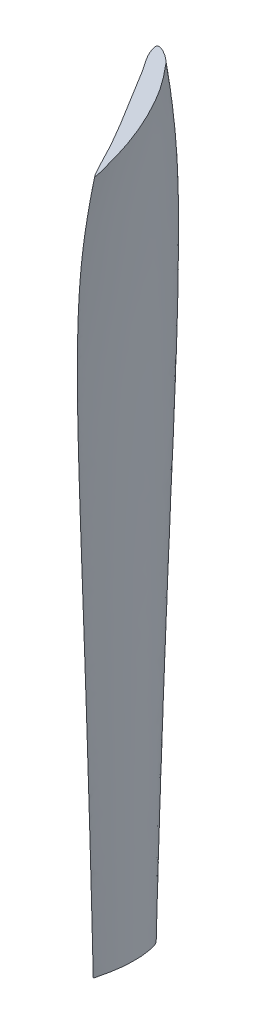
ISO-10303-21;
HEADER;
FILE_DESCRIPTION(('STEP AP214'),'2;1');
FILE_NAME('part.step','',(''),(''),'','','');
FILE_SCHEMA(('AUTOMOTIVE_DESIGN { 1 0 10303 214 1 1 1 1 }'));
ENDSEC;
DATA;
#1=APPLICATION_CONTEXT('core data for automotive mechanical design processes');
#2=APPLICATION_PROTOCOL_DEFINITION('international standard','automotive_design',2000,#1);
#3=PRODUCT_CONTEXT('',#1,'mechanical');
#4=PRODUCT('Part','Part','',(#3));
#5=PRODUCT_RELATED_PRODUCT_CATEGORY('part','',(#4));
#6=PRODUCT_DEFINITION_FORMATION('','',#4);
#7=PRODUCT_DEFINITION_CONTEXT('part definition',#1,'design');
#8=PRODUCT_DEFINITION('design','',#6,#7);
#9=PRODUCT_DEFINITION_SHAPE('','',#8);
#10=(LENGTH_UNIT() NAMED_UNIT(*) SI_UNIT(.MILLI.,.METRE.));
#11=(NAMED_UNIT(*) PLANE_ANGLE_UNIT() SI_UNIT($,.RADIAN.));
#12=(NAMED_UNIT(*) SI_UNIT($,.STERADIAN.) SOLID_ANGLE_UNIT());
#13=UNCERTAINTY_MEASURE_WITH_UNIT(LENGTH_MEASURE(1.E-05),#10,'distance_accuracy_value','');
#14=(GEOMETRIC_REPRESENTATION_CONTEXT(3) GLOBAL_UNCERTAINTY_ASSIGNED_CONTEXT((#13)) GLOBAL_UNIT_ASSIGNED_CONTEXT((#10,
#11,#12)) REPRESENTATION_CONTEXT('',''));
#15=CARTESIAN_POINT('',(0.,0.,0.));
#16=DIRECTION('',(0.,0.,1.));
#17=DIRECTION('',(1.,0.,0.));
#18=AXIS2_PLACEMENT_3D('',#15,#16,#17);
#19=CARTESIAN_POINT('',(0.0157186895464114,-30.48,-1.16227222746938));
#20=DIRECTION('',(-1.25062019432119E-13,-1.,0.));
#21=DIRECTION('',(1.,-1.25062019432119E-13,0.));
#22=AXIS2_PLACEMENT_3D('',#19,#20,#21);
#23=PLANE('',#22);
#24=CARTESIAN_POINT('',(0.049898808,-30.48,1.0506202));
#25=CARTESIAN_POINT('',(0.062181298011678,-30.48,1.05336353258307));
#26=CARTESIAN_POINT('',(0.124583873028353,-30.48,0.760655355643803));
#27=CARTESIAN_POINT('',(0.177610202128464,-30.48,0.535751903327124));
#28=CARTESIAN_POINT('',(0.228017025033434,-30.48,0.173947998585792));
#29=CARTESIAN_POINT('',(0.242584017431504,-30.48,-0.179638407304109));
#30=CARTESIAN_POINT('',(0.230753189717951,-30.48,-0.517913748281402));
#31=CARTESIAN_POINT('',(0.176691479359809,-30.48,-0.821728392154921));
#32=CARTESIAN_POINT('',(0.139307850278164,-30.48,-1.00981587623499));
#33=CARTESIAN_POINT('',(-0.0136371864036877,-30.48,-1.22915572336016));
#34=CARTESIAN_POINT('',(-0.0541103687209295,-30.48,-0.996606442321128));
#35=CARTESIAN_POINT('',(-0.0226785507100077,-30.48,-0.816517084452289));
#36=CARTESIAN_POINT('',(-0.0105979802455246,-30.48,-0.514678939828489));
#37=CARTESIAN_POINT('',(0.012223390379104,-30.48,-0.178391739372337));
#38=CARTESIAN_POINT('',(0.0334925128091805,-30.48,0.173454381904055));
#39=CARTESIAN_POINT('',(0.0473966447907424,-30.48,0.533794157721093));
#40=CARTESIAN_POINT('',(0.0412628972993841,-30.48,0.761870302583174));
#41=CARTESIAN_POINT('',(0.0380688541283339,-30.48,1.04797794278005));
#42=CARTESIAN_POINT('',(0.049898808,-30.48,1.0506202));
#43=B_SPLINE_CURVE_WITH_KNOTS('',3,(#24,#25,#26,#27,#28,#29,#30,#31,#32,#33,#34,#35,#36,#37,#38,
#39,#40,#41,#42),.UNSPECIFIED.,.T.,.F.,(4,1,1,1,1,1,1,1,1,1,1,1,1,1,1,1,4),(0.,
0.0499042290990835,0.117585742091255,0.196099475849759,0.277933365973876,0.355728421398949,
0.422610147432165,0.473113194698633,0.507581508155917,0.5340734610851,0.582151449413021,
0.648386078845603,0.726227551361263,0.808058653690017,0.885809032514325,0.951934442634848,1.),.UNSPECIFIED.);
#44=CARTESIAN_POINT('',(0.049898808,-30.48,1.0506202));
#45=VERTEX_POINT('',#44);
#46=EDGE_CURVE('E11',#45,#45,#43,.T.);
#47=ORIENTED_EDGE('',*,*,#46,.F.);
#48=EDGE_LOOP('',(#47));
#49=FACE_BOUND('',#48,.T.);
#50=ADVANCED_FACE('F133',(#49),#23,.T.);
#51=CARTESIAN_POINT('',(-1.38769956039375,-5.08,-2.67627144628854));
#52=DIRECTION('',(0.,-1.,0.));
#53=DIRECTION('',(0.,0.,-1.));
#54=AXIS2_PLACEMENT_3D('',#51,#52,#53);
#55=PLANE('',#54);
#56=CARTESIAN_POINT('',(1.40094716,-5.08,2.3406608));
#57=CARTESIAN_POINT('',(1.43238584616427,-5.08,2.33188778533643));
#58=CARTESIAN_POINT('',(1.21651270986071,-5.08,1.5863044564638));
#59=CARTESIAN_POINT('',(1.0622548487526,-5.08,1.00721070684705));
#60=CARTESIAN_POINT('',(0.73432578498077,-5.08,0.11836342789297));
#61=CARTESIAN_POINT('',(0.334526557644723,-5.08,-0.707798144113323));
#62=CARTESIAN_POINT('',(-0.106863394645317,-5.08,-1.46662375068857));
#63=CARTESIAN_POINT('',(-0.602586270125994,-5.08,-2.09494231326542));
#64=CARTESIAN_POINT('',(-0.918428180750992,-5.08,-2.47913404435551));
#65=CARTESIAN_POINT('',(-1.53673190649153,-5.08,-2.79321031749995));
#66=CARTESIAN_POINT('',(-1.34441589427649,-5.08,-2.21201959031185));
#67=CARTESIAN_POINT('',(-1.05197395459458,-5.08,-1.83882538546198));
#68=CARTESIAN_POINT('',(-0.654642818928523,-5.08,-1.16360294615252));
#69=CARTESIAN_POINT('',(-0.190563933950765,-5.08,-0.42278461670064));
#70=CARTESIAN_POINT('',(0.289025266022224,-5.08,0.355503173889369));
#71=CARTESIAN_POINT('',(0.762179885391635,-5.08,1.16222944612072));
#72=CARTESIAN_POINT('',(1.02752441163478,-5.08,1.69113726735064));
#73=CARTESIAN_POINT('',(1.37066679259692,-5.08,2.34911058399726));
#74=CARTESIAN_POINT('',(1.40094716,-5.08,2.3406608));
#75=B_SPLINE_CURVE_WITH_KNOTS('',3,(#56,#57,#58,#59,#60,#61,#62,#63,#64,#65,#66,#67,#68,#69,#70,
#71,#72,#73,#74),.UNSPECIFIED.,.T.,.F.,(4,1,1,1,1,1,1,1,1,1,1,1,1,1,1,1,4),(0.,
0.0499045000031389,0.117585674311328,0.196099642767479,0.277933685986463,0.35572859176931,
0.422610252007502,0.47311367030944,0.507581613356843,0.534073080911915,0.582151530742124,
0.648386018827515,0.726227469856398,0.808058517091565,0.88580884531264,0.951934168391572,1.),.UNSPECIFIED.);
#76=CARTESIAN_POINT('',(1.40094716,-5.08,2.3406608));
#77=VERTEX_POINT('',#76);
#78=EDGE_CURVE('E144',#77,#77,#75,.T.);
#79=ORIENTED_EDGE('',*,*,#78,.T.);
#80=EDGE_LOOP('',(#79));
#81=FACE_BOUND('',#80,.T.);
#82=ADVANCED_FACE('F174',(#81),#55,.F.);
#83=CARTESIAN_POINT('',(1.40094716,-5.08,2.3406608));
#84=CARTESIAN_POINT('',(1.27778128642703,-5.92643078703215,2.41200499433178));
#85=CARTESIAN_POINT('',(1.04747557121227,-7.61944176717066,2.48297542598399));
#86=CARTESIAN_POINT('',(0.716560358835949,-10.1570873547836,2.27400982890085));
#87=CARTESIAN_POINT('',(0.500776535547632,-12.6967305693978,2.05092070461862));
#88=CARTESIAN_POINT('',(0.351710809646487,-15.2375738948922,1.83338994399882));
#89=CARTESIAN_POINT('',(0.251182575267671,-17.7783750910469,1.64533006673062));
#90=CARTESIAN_POINT('',(0.181142984651728,-20.3189427988014,1.48464936970091));
#91=CARTESIAN_POINT('',(0.131534763644097,-22.8593094206892,1.34860642339307));
#92=CARTESIAN_POINT('',(0.0955383414889097,-25.3995395303378,1.23287248602043));
#93=CARTESIAN_POINT('',(0.0691369906348381,-27.9396954219791,1.1341166253429));
#94=CARTESIAN_POINT('',(0.0555142684237271,-29.6332392153276,1.07686902533856));
#95=CARTESIAN_POINT('',(0.049898808,-30.48,1.0506202));
#96=CARTESIAN_POINT('',(1.39700980387952,-5.08,2.34175952539839));
#97=CARTESIAN_POINT('',(1.27378966033151,-5.92643091249303,2.41289649150168));
#98=CARTESIAN_POINT('',(1.04347227647872,-7.61944170896178,2.48350747809207));
#99=CARTESIAN_POINT('',(0.712990205072126,-10.1570873703868,2.27414560891697));
#100=CARTESIAN_POINT('',(0.497614083614096,-12.6967305650598,2.05083299789722));
#101=CARTESIAN_POINT('',(0.348921812651149,-15.2375738966921,1.83317287047209));
#102=CARTESIAN_POINT('',(0.248705103885671,-17.7783750881789,1.64504208483902));
#103=CARTESIAN_POINT('',(0.178925482983493,-20.3189428084611,1.48432397569785));
#104=CARTESIAN_POINT('',(0.129533553341587,-22.8593093849535,1.34826212075185));
#105=CARTESIAN_POINT('',(0.0937185334445583,-25.3995396635336,1.23252605969023));
#106=CARTESIAN_POINT('',(0.0674707282312418,-27.939694925149,1.13375545148902));
#107=CARTESIAN_POINT('',(0.0539352610077255,-29.6332402855858,1.07654979046761));
#108=CARTESIAN_POINT('',(0.0483605503421055,-30.48,1.05027662533802));
#109=CARTESIAN_POINT('',(1.36709545936726,-5.08,2.32186446235665));
#110=CARTESIAN_POINT('',(1.24492972363605,-5.92643565606058,2.39145105990447));
#111=CARTESIAN_POINT('',(1.01694466015745,-7.6194395084711,2.45990073355303));
#112=CARTESIAN_POINT('',(0.691633254759536,-10.1570879591526,2.25123615778126));
#113=CARTESIAN_POINT('',(0.480054245255558,-12.6967304054009,2.02929568548133));
#114=CARTESIAN_POINT('',(0.334371878808419,-15.2375739485437,1.81336037570565));
#115=CARTESIAN_POINT('',(0.236409966742215,-17.7783750400476,1.62691505621074));
#116=CARTESIAN_POINT('',(0.168373696377399,-20.318942949012,1.46761013663171));
#117=CARTESIAN_POINT('',(0.12034110731012,-22.859308871377,1.33328481339791));
#118=CARTESIAN_POINT('',(0.085653634988587,-25.3995415760398,1.21765592020702));
#119=CARTESIAN_POINT('',(0.0600837221565524,-27.939687791819,1.12364158909274));
#120=CARTESIAN_POINT('',(0.0470389923501114,-29.6332556519332,1.06647300950178));
#121=CARTESIAN_POINT('',(0.0416880054142354,-30.48,1.04011211064734));
#122=CARTESIAN_POINT('',(1.22409976139633,-5.08,2.07273842927985));
#123=CARTESIAN_POINT('',(1.11499496133002,-5.92647276906755,2.13497826673415));
#124=CARTESIAN_POINT('',(0.911355304328161,-7.61942229212017,2.19632665244251));
#125=CARTESIAN_POINT('',(0.620911426110765,-10.1570925656456,2.01106108994917));
#126=CARTESIAN_POINT('',(0.431368142260886,-12.6967291559859,1.81257360213513));
#127=CARTESIAN_POINT('',(0.300997926040138,-15.2375743552128,1.61967039945365));
#128=CARTESIAN_POINT('',(0.213214196969777,-17.7783746597929,1.45337694733169));
#129=CARTESIAN_POINT('',(0.152245128249323,-20.31894406238,1.31030483499396));
#130=CARTESIAN_POINT('',(0.109157783662763,-22.8593048020909,1.19359824706943));
#131=CARTESIAN_POINT('',(0.0783980913444241,-25.3995567299215,1.08149467037754));
#132=CARTESIAN_POINT('',(0.0538336226735565,-27.9396312702883,1.02867195783913));
#133=CARTESIAN_POINT('',(0.0421236401843173,-29.6333774084725,0.973898557552879));
#134=CARTESIAN_POINT('',(0.0373939002388563,-30.48,0.946501084684309));
#135=CARTESIAN_POINT('',(1.00693991362816,-5.08000000000001,1.64550951025166));
#136=CARTESIAN_POINT('',(0.92033059766842,-5.92655739550925,1.69672043173318));
#137=CARTESIAN_POINT('',(0.757993078717222,-7.61938303972482,1.74846610736303));
#138=CARTESIAN_POINT('',(0.522405477410743,-10.1571030522063,1.60374730212956));
#139=CARTESIAN_POINT('',(0.368431435537863,-12.6967263711845,1.44793532878533));
#140=CARTESIAN_POINT('',(0.261398784822616,-15.2375750439937,1.29497240145854));
#141=CARTESIAN_POINT('',(0.189014189051383,-17.7783746805686,1.16276266579985));
#142=CARTESIAN_POINT('',(0.138354155455108,-20.3189432933383,1.04975768757835));
#143=CARTESIAN_POINT('',(0.102211575428987,-22.8593078541443,0.952413465822633));
#144=CARTESIAN_POINT('',(0.0758812168876077,-25.3995452982818,0.871236128744482));
#145=CARTESIAN_POINT('',(0.0570495956875119,-27.9396739261336,0.802751243775289));
#146=CARTESIAN_POINT('',(0.0469555375101602,-29.63328551771,0.762209797664295));
#147=CARTESIAN_POINT('',(0.0427352291163434,-30.48,0.743513942588085));
#148=CARTESIAN_POINT('',(0.860083406694233,-5.07999999999999,1.36125161387565));
#149=CARTESIAN_POINT('',(0.789178500918983,-5.92675659091788,1.40832452802361));
#150=CARTESIAN_POINT('',(0.655164573307827,-7.61929064363724,1.45647279649003));
#151=CARTESIAN_POINT('',(0.448416564371003,-10.1571277462195,1.3052051573593));
#152=CARTESIAN_POINT('',(0.322346315149617,-12.6967197772608,1.18703175023137));
#153=CARTESIAN_POINT('',(0.231681381918034,-15.2375768102546,1.06058115587115));
#154=CARTESIAN_POINT('',(0.170590043393699,-17.7783741897577,0.953039958627092));
#155=CARTESIAN_POINT('',(0.127417789121077,-20.3189434939232,0.86068947262639));
#156=CARTESIAN_POINT('',(0.0966131776601687,-22.8593075422374,0.782086155820854));
#157=CARTESIAN_POINT('',(0.0738364623926254,-25.39954634476,0.716521712861613));
#158=CARTESIAN_POINT('',(0.0574232306792985,-27.9396700537997,0.655447190901884));
#159=CARTESIAN_POINT('',(0.0486187259384814,-29.6332938538326,0.622854951018198));
#160=CARTESIAN_POINT('',(0.044926914263238,-30.48,0.608160994269926));
#161=CARTESIAN_POINT('',(0.703390609799626,-5.08,1.06945966284957));
#162=CARTESIAN_POINT('',(0.646738630941161,-5.92654911432795,1.10393904865062));
#163=CARTESIAN_POINT('',(0.539808562538208,-7.61938688050085,1.14033940576483));
#164=CARTESIAN_POINT('',(0.384149229943514,-10.1571020270684,1.06401640032938));
#165=CARTESIAN_POINT('',(0.276154958267755,-12.6967266398733,0.956797714540188));
#166=CARTESIAN_POINT('',(0.202012536461835,-15.2375749907938,0.85858600980791));
#167=CARTESIAN_POINT('',(0.150722738278815,-17.7783746256743,0.771187567683224));
#168=CARTESIAN_POINT('',(0.114501388311614,-20.318943565535,0.695846654674289));
#169=CARTESIAN_POINT('',(0.0887989329373363,-22.8593068213107,0.637551143162792));
#170=CARTESIAN_POINT('',(0.0694526686231361,-25.3995491548906,0.581306924859225));
#171=CARTESIAN_POINT('',(0.0546219342441351,-27.9396595388234,0.537488105942003));
#172=CARTESIAN_POINT('',(0.0470808122762938,-29.6333165108052,0.510316208151042));
#173=CARTESIAN_POINT('',(0.0439528237016477,-30.48,0.497764298309623));
#174=CARTESIAN_POINT('',(0.521744727348833,-5.08,0.75349620999737));
#175=CARTESIAN_POINT('',(0.482190737245425,-5.92666732160427,0.78086708970373));
#176=CARTESIAN_POINT('',(0.406771940210008,-7.61933205044298,0.810535356031964));
#177=CARTESIAN_POINT('',(0.289367763071413,-10.157116681185,0.740212770955006));
#178=CARTESIAN_POINT('',(0.213317424872538,-12.696722726498,0.673995527688344));
#179=CARTESIAN_POINT('',(0.158418174991844,-15.2375760403644,0.603643875026136));
#180=CARTESIAN_POINT('',(0.120815559006764,-17.7783743290943,0.544559432981544));
#181=CARTESIAN_POINT('',(0.0935841964948799,-20.3189437043909,0.489062515624401));
#182=CARTESIAN_POINT('',(0.0747342488519041,-22.8593065623163,0.456594678362163));
#183=CARTESIAN_POINT('',(0.0597318267451517,-25.399550051497,0.414515555217572));
#184=CARTESIAN_POINT('',(0.0485459084996442,-27.9396562128339,0.383439233047924));
#185=CARTESIAN_POINT('',(0.0426520586380554,-29.6333236722734,0.364024303790033));
#186=CARTESIAN_POINT('',(0.0401783489449294,-30.48,0.355146831708664));
#187=CARTESIAN_POINT('',(0.327594926511205,-5.08,0.425241302049337));
#188=CARTESIAN_POINT('',(0.305074775895395,-5.92664950657036,0.441640737924192));
#189=CARTESIAN_POINT('',(0.261603031386557,-7.61934031379656,0.460409733059054));
#190=CARTESIAN_POINT('',(0.193085046665425,-10.1571144729812,0.431188643482622));
#191=CARTESIAN_POINT('',(0.145119879539118,-12.6967233150986,0.39056586890181));
#192=CARTESIAN_POINT('',(0.111028384982007,-15.237575886588,0.351833665576553));
#193=CARTESIAN_POINT('',(0.0869343981256386,-17.7783743573969,0.316646153482897));
#194=CARTESIAN_POINT('',(0.0695428034090461,-20.3189437445462,0.287889728637838));
#195=CARTESIAN_POINT('',(0.0566872354373561,-22.8593063736428,0.258541251519454));
#196=CARTESIAN_POINT('',(0.0469591833663303,-25.3995507655577,0.238375955122035));
#197=CARTESIAN_POINT('',(0.0398332290463775,-27.9396535464326,0.217966595506903));
#198=CARTESIAN_POINT('',(0.0358337275570815,-29.6333294166825,0.207347933711566));
#199=CARTESIAN_POINT('',(0.0341041569733386,-30.48,0.202524488617393));
#200=CARTESIAN_POINT('',(0.135350731479312,-5.07999999999999,0.10769732427186));
#201=CARTESIAN_POINT('',(0.129675011026332,-5.92666977232785,0.114879574949974));
#202=CARTESIAN_POINT('',(0.117646197574036,-7.61933091354864,0.124436799822662));
#203=CARTESIAN_POINT('',(0.0928272024114742,-10.1571169854694,0.117287582813142));
#204=CARTESIAN_POINT('',(0.075396528147237,-12.6967226436281,0.109881314047684));
#205=CARTESIAN_POINT('',(0.0616782464640057,-15.2375760685788,0.100119342971943));
#206=CARTESIAN_POINT('',(0.0515805366846222,-17.7783742989207,0.0915746742476821));
#207=CARTESIAN_POINT('',(0.0438632685164775,-20.3189437967771,0.0831350948704369));
#208=CARTESIAN_POINT('',(0.0378339391015915,-22.8593062232748,0.0779108998407389));
#209=CARTESIAN_POINT('',(0.0331756877715342,-25.3995513144516,0.071028574941251));
#210=CARTESIAN_POINT('',(0.029191766338835,-27.9396515021169,0.0669013442622828));
#211=CARTESIAN_POINT('',(0.0271270232668996,-29.6333338199395,0.0636612815757055));
#212=CARTESIAN_POINT('',(0.0262309147671311,-30.48,0.0621131631861524));
#213=CARTESIAN_POINT('',(-0.0547789495885922,-5.08000000000001,-0.202046851421453));
#214=CARTESIAN_POINT('',(-0.0442193189636415,-5.92666652291648,-0.204860448524149));
#215=CARTESIAN_POINT('',(-0.0257641263728181,-7.61933242078096,-0.205422027268839));
#216=CARTESIAN_POINT('',(-0.00539275225699148,-10.1571165826289,-0.181994018923111));
#217=CARTESIAN_POINT('',(0.00572005255645679,-12.6967227512476,-0.161515969382117));
#218=CARTESIAN_POINT('',(0.0122155818325014,-15.2375760395625,-0.142261708966033));
#219=CARTESIAN_POINT('',(0.0156913446249202,-17.7783743076859,-0.126486971690394));
#220=CARTESIAN_POINT('',(0.0175090565951182,-20.3189437906786,-0.112920227533355));
#221=CARTESIAN_POINT('',(0.0183774128838644,-22.8593062388995,-0.102727119987911));
#222=CARTESIAN_POINT('',(0.0185905718268447,-25.3995512580865,-0.0930135288524093));
#223=CARTESIAN_POINT('',(0.0186065765327255,-27.9396517118607,-0.0858066110114175));
#224=CARTESIAN_POINT('',(0.0184091979719757,-29.6333333682046,-0.0812191313918362));
#225=CARTESIAN_POINT('',(0.0182649012114125,-30.48,-0.0791013441155834));
#226=CARTESIAN_POINT('',(-0.245908220493335,-5.07999999999999,-0.509847484958227));
#227=CARTESIAN_POINT('',(-0.219102959023463,-5.92665717814351,-0.522235639733509));
#228=CARTESIAN_POINT('',(-0.170174684785107,-7.61933675536502,-0.532555827727952));
#229=CARTESIAN_POINT('',(-0.105814403515541,-10.1571154240145,-0.483748830616579));
#230=CARTESIAN_POINT('',(-0.0652974216217071,-12.6967230611567,-0.433472338821281));
#231=CARTESIAN_POINT('',(-0.0385472539613965,-15.2375759545794,-0.385755960396873));
#232=CARTESIAN_POINT('',(-0.0212514695740547,-17.7783743386143,-0.344892955525923));
#233=CARTESIAN_POINT('',(-0.00976731801714596,-20.3189437518243,-0.310511424731755));
#234=CARTESIAN_POINT('',(-0.00206852855155911,-22.8593063632965,-0.281000343622873));
#235=CARTESIAN_POINT('',(0.0032366854105813,-25.3995507996468,-0.256616145979663));
#236=CARTESIAN_POINT('',(0.0067865686048866,-27.9396534204772,-0.235374432902474));
#237=CARTESIAN_POINT('',(0.00854274227419979,-29.6333296877981,-0.223321397638403));
#238=CARTESIAN_POINT('',(0.00922139160907255,-30.48,-0.217822275468259));
#239=CARTESIAN_POINT('',(-0.43692697195276,-5.08,-0.816268192622552));
#240=CARTESIAN_POINT('',(-0.394013602580028,-5.92664099767442,-0.838487390151797));
#241=CARTESIAN_POINT('',(-0.314808815528985,-7.61934426069718,-0.858833734810288));
#242=CARTESIAN_POINT('',(-0.205955636223482,-10.1571134178667,-0.782415433629516));
#243=CARTESIAN_POINT('',(-0.136439268711224,-12.696723597792,-0.703160492164974));
#244=CARTESIAN_POINT('',(-0.0894385174010106,-15.2375758073286,-0.627019989989802));
#245=CARTESIAN_POINT('',(-0.058434965896887,-17.7783743925493,-0.561729111217014));
#246=CARTESIAN_POINT('',(-0.0372955440939636,-20.318943683123,-0.506038107535369));
#247=CARTESIAN_POINT('',(-0.0226784250820971,-22.8593065840023,-0.459358126138431));
#248=CARTESIAN_POINT('',(-0.012371686359618,-25.399549986048,-0.419470291099731));
#249=CARTESIAN_POINT('',(-0.00498821938010917,-27.9396564528419,-0.385732417111443));
#250=CARTESIAN_POINT('',(-0.00130483128532693,-29.633323155991,-0.366098191631045));
#251=CARTESIAN_POINT('',(0.000167597918726979,-30.4800000000001,-0.357101184112708));
#252=CARTESIAN_POINT('',(-0.631440850298294,-5.08,-1.13192540458864));
#253=CARTESIAN_POINT('',(-0.571891849673466,-5.92661398392929,-1.16399803334085));
#254=CARTESIAN_POINT('',(-0.461492944701545,-7.61935679105383,-1.19436561990713));
#255=CARTESIAN_POINT('',(-0.307357276327262,-10.1571100685641,-1.09027392370671));
#256=CARTESIAN_POINT('',(-0.208157503153315,-12.6967244936562,-0.981647007290554));
#257=CARTESIAN_POINT('',(-0.140502916490108,-15.2375755617238,-0.876081580374542));
#258=CARTESIAN_POINT('',(-0.0954544983359994,-17.7783744817214,-0.785210690704693));
#259=CARTESIAN_POINT('',(-0.0645304362563312,-20.3189435716804,-0.70794504980153));
#260=CARTESIAN_POINT('',(-0.0429440570203945,-22.8593069403389,-0.642487024491648));
#261=CARTESIAN_POINT('',(-0.0275070950002347,-25.3995486729872,-0.586971230344392));
#262=CARTESIAN_POINT('',(-0.0164215165775531,-27.939661346612,-0.539615093499802));
#263=CARTESIAN_POINT('',(-0.0107749229361149,-29.6333126146839,-0.512204136178297));
#264=CARTESIAN_POINT('',(-0.00848448981291489,-30.4799999999999,-0.499647940275508));
#265=CARTESIAN_POINT('',(-0.821691805311017,-5.08,-1.44828150591257));
#266=CARTESIAN_POINT('',(-0.74551764208252,-5.92657874790718,-1.49009138655135));
#267=CARTESIAN_POINT('',(-0.603996880769097,-7.61937313532556,-1.53011820480454));
#268=CARTESIAN_POINT('',(-0.405065289112894,-10.1571056998131,-1.39823284599796));
#269=CARTESIAN_POINT('',(-0.276432767268611,-12.6967256622289,-1.25811311318379));
#270=CARTESIAN_POINT('',(-0.188567655226749,-15.2375752412497,-1.12342456431561));
#271=CARTESIAN_POINT('',(-0.129940385752425,-17.7783745984587,-1.00738856093221));
#272=CARTESIAN_POINT('',(-0.0894494769056676,-20.3189434247395,-0.908269763265217));
#273=CARTESIAN_POINT('',(-0.061112132891369,-22.8593074110174,-0.824600521038328));
#274=CARTESIAN_POINT('',(-0.0408125489279891,-25.3995469383282,-0.753613917522465));
#275=CARTESIAN_POINT('',(-0.0260867951283854,-27.9396678117457,-0.692972289844512));
#276=CARTESIAN_POINT('',(-0.0185936133356453,-29.6332986886068,-0.657902310245891));
#277=CARTESIAN_POINT('',(-0.0155445222538459,-30.4800000000001,-0.641837804394526));
#278=CARTESIAN_POINT('',(-1.02159205782382,-5.07999999999999,-1.77629494038124));
#279=CARTESIAN_POINT('',(-0.928122918263087,-5.92653570010902,-1.82823348231052));
#280=CARTESIAN_POINT('',(-0.75421343201836,-7.61939310310524,-1.87854792908362));
#281=CARTESIAN_POINT('',(-0.508284677566144,-10.1571003624945,-1.71660714814156));
#282=CARTESIAN_POINT('',(-0.349344354167996,-12.6967270899525,-1.5477472519768));
#283=CARTESIAN_POINT('',(-0.240255925978484,-15.2375748494286,-1.38216839365587));
#284=CARTESIAN_POINT('',(-0.167113597498268,-17.7783747421865,-1.23934335115743));
#285=CARTESIAN_POINT('',(-0.116674533666938,-20.3189432410867,-1.11786899966394));
#286=CARTESIAN_POINT('',(-0.081184288282853,-22.8593080014614,-1.01503800372191));
#287=CARTESIAN_POINT('',(-0.055618363317915,-25.3995447616031,-0.92733707196324));
#288=CARTESIAN_POINT('',(-0.037099314222694,-27.9396759246597,-0.852895421818419));
#289=CARTESIAN_POINT('',(-0.0276012428229864,-29.6332812131319,-0.809600137601351));
#290=CARTESIAN_POINT('',(-0.0237187788421135,-30.48,-0.78974699467398));
#291=CARTESIAN_POINT('',(-1.17445997586916,-5.08000000000001,-1.98589898288259));
#292=CARTESIAN_POINT('',(-1.06999328250411,-5.92649476803701,-2.04572680249802));
#293=CARTESIAN_POINT('',(-0.874938778069082,-7.61941208949345,-2.10481319332278));
#294=CARTESIAN_POINT('',(-0.596119353103713,-10.1570952875279,-1.92700811153502));
#295=CARTESIAN_POINT('',(-0.414409418651867,-12.6967284473888,-1.73734111415621));
#296=CARTESIAN_POINT('',(-0.289033355251842,-15.2375744773011,-1.55225342061663));
#297=CARTESIAN_POINT('',(-0.205018928332852,-17.7783748772272,-1.39314929900616));
#298=CARTESIAN_POINT('',(-0.146362957737165,-20.3189430725068,-1.25660759489335));
#299=CARTESIAN_POINT('',(-0.105032758359649,-22.8593085403438,-1.14122050065271));
#300=CARTESIAN_POINT('',(-0.0751675569551913,-25.3995427759288,-1.04353324765823));
#301=CARTESIAN_POINT('',(-0.0532607989296206,-27.9396833252431,-0.959713353923026));
#302=CARTESIAN_POINT('',(-0.0420206669804454,-29.6332652720874,-0.91138042182681));
#303=CARTESIAN_POINT('',(-0.0374037207317797,-30.48,-0.889243974783154));
#304=CARTESIAN_POINT('',(-1.30916589426653,-5.07999999999999,-2.19717582304094));
#305=CARTESIAN_POINT('',(-1.19353442129163,-5.92646075738064,-2.26382301063265));
#306=CARTESIAN_POINT('',(-0.977451900119419,-7.61942786538346,-2.32988554884182));
#307=CARTESIAN_POINT('',(-0.667547113924165,-10.1570910706843,-2.13316470671996));
#308=CARTESIAN_POINT('',(-0.465676354258069,-12.6967295753972,-1.9234370244199));
#309=CARTESIAN_POINT('',(-0.326708958090572,-15.2375741676963,-1.71969386496152));
#310=CARTESIAN_POINT('',(-0.232603052974875,-17.7783749909298,-1.5428958969644));
#311=CARTESIAN_POINT('',(-0.16740631994238,-20.3189429268575,-1.39248778948722));
#312=CARTESIAN_POINT('',(-0.121103688256768,-22.859309008889,-1.26492772460945));
#313=CARTESIAN_POINT('',(-0.0875156801145166,-25.3995410485065,-1.15613451969737));
#314=CARTESIAN_POINT('',(-0.0629407736541695,-27.9396897635752,-1.06357934346593));
#315=CARTESIAN_POINT('',(-0.0502453240944646,-29.6332514037107,-1.00977263007434));
#316=CARTESIAN_POINT('',(-0.0450130015422882,-30.48,-0.985088486388272));
#317=CARTESIAN_POINT('',(-1.39604877662881,-5.08000000000001,-2.38080814391061));
#318=CARTESIAN_POINT('',(-1.27080479572703,-5.92642522083708,-2.45186219651462));
#319=CARTESIAN_POINT('',(-1.03717889420609,-7.61944434906601,-2.52159788503261));
#320=CARTESIAN_POINT('',(-0.70419909076338,-10.1570866646254,-2.30729375752686));
#321=CARTESIAN_POINT('',(-0.488058759829654,-12.6967307541124,-2.07995494881625));
#322=CARTESIAN_POINT('',(-0.33848265143129,-15.2375738438345,-1.85731051532548));
#323=CARTESIAN_POINT('',(-0.238874193991562,-17.7783751110988,-1.66666845032332));
#324=CARTESIAN_POINT('',(-0.16901605709427,-20.3189427695872,-1.50254331471091));
#325=CARTESIAN_POINT('',(-0.120185797972949,-22.8593095174163,-1.36430669881821));
#326=CARTESIAN_POINT('',(-0.0849169291642063,-25.3995391728743,-1.2471891045011));
#327=CARTESIAN_POINT('',(-0.0591452246713082,-27.9396967545242,-1.14700875718649));
#328=CARTESIAN_POINT('',(-0.045947751976754,-29.633236344941,-1.08915333459521));
#329=CARTESIAN_POINT('',(-0.0405403405665615,-30.48,-1.06265513637228));
#330=CARTESIAN_POINT('',(-1.46158341517951,-5.07999999999999,-2.5758516574335));
#331=CARTESIAN_POINT('',(-1.32608765554492,-5.92638755638093,-2.65018517995174));
#332=CARTESIAN_POINT('',(-1.07428443025193,-7.61946181974592,-2.72137278567675));
#333=CARTESIAN_POINT('',(-0.720624902961467,-10.1570819948676,-2.48633881697747));
#334=CARTESIAN_POINT('',(-0.491760015804261,-12.6967320029131,-2.23818762025456));
#335=CARTESIAN_POINT('',(-0.336403911143579,-15.2375735024214,-2.00049978704202));
#336=CARTESIAN_POINT('',(-0.231502299990148,-17.7783752316086,-1.7929565706123));
#337=CARTESIAN_POINT('',(-0.160214493515466,-20.3189426284386,-1.61826878698117));
#338=CARTESIAN_POINT('',(-0.109470032990978,-22.8593099611892,-1.46877188315948));
#339=CARTESIAN_POINT('',(-0.0732536299717543,-25.3995375399769,-1.34214852376425));
#340=CARTESIAN_POINT('',(-0.0470150571154285,-27.9397028396841,-1.23420646296507));
#341=CARTESIAN_POINT('',(-0.033602014174178,-29.633223237464,-1.17154436797827));
#342=CARTESIAN_POINT('',(-0.0281292035199799,-30.48,-1.14279993771489));
#343=CARTESIAN_POINT('',(-1.44577087521694,-5.08,-2.66280185917476));
#344=CARTESIAN_POINT('',(-1.30577246103319,-5.92637669444846,-2.73624167097542));
#345=CARTESIAN_POINT('',(-1.04688101065667,-7.61946685806655,-2.80431322771491));
#346=CARTESIAN_POINT('',(-0.689322260359375,-10.1570806481467,-2.55687339998561));
#347=CARTESIAN_POINT('',(-0.460395306436644,-12.6967323631406,-2.29984352221391));
#348=CARTESIAN_POINT('',(-0.304433385136616,-15.2375734036284,-2.04924466418998));
#349=CARTESIAN_POINT('',(-0.20199915725126,-17.7783752676053,-1.83683906324762));
#350=CARTESIAN_POINT('',(-0.1314766383636,-20.3189425831012,-1.65460964497999));
#351=CARTESIAN_POINT('',(-0.0828985276478092,-22.8593101064346,-1.5016171289411));
#352=CARTESIAN_POINT('',(-0.0483677654879971,-25.3995370046762,-1.37155269487389));
#353=CARTESIAN_POINT('',(-0.0237245761451747,-27.9397048347699,-1.26088498811173));
#354=CARTESIAN_POINT('',(-0.0112467772392856,-29.6332189399935,-1.19660181408247));
#355=CARTESIAN_POINT('',(-0.00621511966399843,-30.48,-1.16711886184581));
#356=CARTESIAN_POINT('',(-1.37725584742193,-5.08,-2.69020512613375));
#357=CARTESIAN_POINT('',(-1.23588974970632,-5.92638073615018,-2.76006139018404));
#358=CARTESIAN_POINT('',(-0.976095682427701,-7.61946498333899,-2.82161644902054));
#359=CARTESIAN_POINT('',(-0.625424752243951,-10.1570811491863,-2.56642077100249));
#360=CARTESIAN_POINT('',(-0.403360762135771,-12.6967322293686,-2.30345783424607));
#361=CARTESIAN_POINT('',(-0.254423116381372,-15.2375734393933,-2.05432227835565));
#362=CARTESIAN_POINT('',(-0.157185888797726,-17.7783752579178,-1.83855322985958));
#363=CARTESIAN_POINT('',(-0.0908271496857307,-20.318942586161,-1.6544369943563));
#364=CARTESIAN_POINT('',(-0.0461443978057495,-22.8593101038713,-1.50060338133295));
#365=CARTESIAN_POINT('',(-0.0148487679022165,-25.3995370118675,-1.37000819779953));
#366=CARTESIAN_POINT('',(0.00704966761920409,-27.9397048085792,-1.25893227249865));
#367=CARTESIAN_POINT('',(0.0179310228357833,-29.6332189962996,-1.19451632915918));
#368=CARTESIAN_POINT('',(0.0222305591341044,-30.48,-1.16499702559641));
#369=CARTESIAN_POINT('',(-1.20329333757774,-5.08000000000001,-2.62260872112905));
#370=CARTESIAN_POINT('',(-1.06553183609128,-5.92639724304465,-2.6834031196936));
#371=CARTESIAN_POINT('',(-0.815122203782767,-7.61945732657244,-2.73145950083856));
#372=CARTESIAN_POINT('',(-0.491721368154387,-10.1570831958816,-2.4739058608243));
#373=CARTESIAN_POINT('',(-0.290001464957636,-12.6967316816279,-2.2143947976952));
#374=CARTESIAN_POINT('',(-0.159130420850555,-15.2375735906534,-1.96771318268779));
#375=CARTESIAN_POINT('',(-0.0740695093998691,-17.7783751990285,-1.7570641696215));
#376=CARTESIAN_POINT('',(-0.0222517236724578,-20.318942670652,-1.58677498722579));
#377=CARTESIAN_POINT('',(0.0154267305454174,-22.8593098250178,-1.4359931635476));
#378=CARTESIAN_POINT('',(0.0399957345730779,-25.3995380421263,-1.31016520778581));
#379=CARTESIAN_POINT('',(0.0565942226977127,-27.9397009680755,-1.20299061415817));
#380=CARTESIAN_POINT('',(0.0643895505678533,-29.6332272689754,-1.14119277713565));
#381=CARTESIAN_POINT('',(0.0672996708912932,-30.4800000000001,-1.11293802503745));
#382=CARTESIAN_POINT('',(-0.996302996025749,-5.07999999999999,-2.49342574154651));
#383=CARTESIAN_POINT('',(-0.865493595019872,-5.92644575609193,-2.5435844277041));
#384=CARTESIAN_POINT('',(-0.630646633499311,-7.61943482378443,-2.57668214754903));
#385=CARTESIAN_POINT('',(-0.341122777358304,-10.1570892106219,-2.32139460211531));
#386=CARTESIAN_POINT('',(-0.166883725883397,-12.6967300733541,-2.07145813982868));
#387=CARTESIAN_POINT('',(-0.0548578453977861,-15.2375740295782,-1.8360666866372));
#388=CARTESIAN_POINT('',(0.0115365372435508,-17.7783750468841,-1.64095941199656));
#389=CARTESIAN_POINT('',(0.061055250233728,-20.3189428409958,-1.46106330411994));
#390=CARTESIAN_POINT('',(0.0856655566599309,-22.8593092961468,-1.32512112698608));
#391=CARTESIAN_POINT('',(0.102431199274442,-25.3995399860239,-1.20716239145837));
#392=CARTESIAN_POINT('',(0.112299732258475,-27.9396937245178,-1.10757949098362));
#393=CARTESIAN_POINT('',(0.116424597130432,-29.6332428715461,-1.05009278287541));
#394=CARTESIAN_POINT('',(0.117695004349596,-30.48,-1.02385433957764));
#395=CARTESIAN_POINT('',(-0.839948610151504,-5.08000000000001,-2.36590389622889));
#396=CARTESIAN_POINT('',(-0.715896627682025,-5.92646883157991,-2.40798815602384));
#397=CARTESIAN_POINT('',(-0.495281947691133,-7.61942412016818,-2.43039404342383));
#398=CARTESIAN_POINT('',(-0.234303303490046,-10.1570920717253,-2.18145573665002));
#399=CARTESIAN_POINT('',(-0.0805739242892021,-12.6967293077767,-1.9421387127673));
#400=CARTESIAN_POINT('',(0.0143183425102916,-15.2375742405614,-1.71861057255704));
#401=CARTESIAN_POINT('',(0.0707615318509512,-17.7783749663028,-1.53122050742018));
#402=CARTESIAN_POINT('',(0.106292799289087,-20.3189429526189,-1.37138312683539));
#403=CARTESIAN_POINT('',(0.125994010446177,-22.8593089305203,-1.24018814231521));
#404=CARTESIAN_POINT('',(0.137437921341916,-25.399541336037,-1.12936545897498));
#405=CARTESIAN_POINT('',(0.143349604668015,-27.9396886922898,-1.03547306046452));
#406=CARTESIAN_POINT('',(0.145244182484097,-29.6332537112266,-0.98137708221176));
#407=CARTESIAN_POINT('',(0.145543171404963,-30.48,-0.956687267228374));
#408=CARTESIAN_POINT('',(-0.696789114769372,-5.08,-2.2122681541526));
#409=CARTESIAN_POINT('',(-0.580862365643365,-5.92650686648243,-2.24703321827162));
#410=CARTESIAN_POINT('',(-0.376402630979103,-7.61940647767169,-2.26031782671131));
#411=CARTESIAN_POINT('',(-0.14348324148187,-10.1570967873593,-2.02124716602121));
#412=CARTESIAN_POINT('',(-0.00916046316423441,-12.6967280468898,-1.79426515351455));
#413=CARTESIAN_POINT('',(0.0719117913505781,-15.2375745846023,-1.58370022597433));
#414=CARTESIAN_POINT('',(0.117781858025328,-17.7783748473252,-1.40853803318413));
#415=CARTESIAN_POINT('',(0.14299381633359,-20.318943085032,-1.26323936652009));
#416=CARTESIAN_POINT('',(0.157362526345527,-22.8593085201235,-1.14080241904931));
#417=CARTESIAN_POINT('',(0.164388589652448,-25.3995428442469,-1.03762436166585));
#418=CARTESIAN_POINT('',(0.166680604954245,-27.9396830723004,-0.950928540284199));
#419=CARTESIAN_POINT('',(0.166655816588561,-29.6332658166322,-0.900873718048582));
#420=CARTESIAN_POINT('',(0.166121769503108,-30.48,-0.878054174601099));
#421=CARTESIAN_POINT('',(-0.511203005987037,-5.08000000000001,-1.97747681104076));
#422=CARTESIAN_POINT('',(-0.407615404902384,-5.92652515846206,-2.00259678886055));
#423=CARTESIAN_POINT('',(-0.227176750989568,-7.61939799280978,-2.00481820376199));
#424=CARTESIAN_POINT('',(-0.034159967127821,-10.1570990556637,-1.78569816528846));
#425=CARTESIAN_POINT('',(0.073942372455586,-12.6967274388943,-1.5795439004996));
#426=CARTESIAN_POINT('',(0.134112283173266,-15.237574756016,-1.39283504720366));
#427=CARTESIAN_POINT('',(0.166846952260192,-17.7783747679376,-1.23619854863504));
#428=CARTESIAN_POINT('',(0.183675557491605,-20.3189432313025,-1.10538019604708));
#429=CARTESIAN_POINT('',(0.190501093142961,-22.8593080148698,-0.997120300880115));
#430=CARTESIAN_POINT('',(0.191829301809914,-25.3995447177762,-0.90665680596066));
#431=CARTESIAN_POINT('',(0.189968401945989,-27.9396760864888,-0.829971321602822));
#432=CARTESIAN_POINT('',(0.187654574080632,-29.6332808648182,-0.785974934188548));
#433=CARTESIAN_POINT('',(0.186141840724335,-30.48,-0.765932540434668));
#434=CARTESIAN_POINT('',(-0.287440545938389,-5.08,-1.69121528645246));
#435=CARTESIAN_POINT('',(-0.198995093162191,-5.92657914719931,-1.70498499040864));
#436=CARTESIAN_POINT('',(-0.0478706308335963,-7.61937295014097,-1.69411605571302));
#437=CARTESIAN_POINT('',(0.0987310322349196,-10.1571057492231,-1.49559148833684));
#438=CARTESIAN_POINT('',(0.174131649528937,-12.6967256493436,-1.31591655731328));
#439=CARTESIAN_POINT('',(0.212482997900528,-15.2375752435544,-1.15350740950813));
#440=CARTESIAN_POINT('',(0.228310547623283,-17.7783746020749,-1.02067870433117));
#441=CARTESIAN_POINT('',(0.232483319747624,-20.3189434080035,-0.910764837521799));
#442=CARTESIAN_POINT('',(0.230542355332069,-22.8593074742808,-0.819802295462604));
#443=CARTESIAN_POINT('',(0.225270797376325,-25.3995467021651,-0.743639324424826));
#444=CARTESIAN_POINT('',(0.218190638718773,-27.9396686927501,-0.679847916237811));
#445=CARTESIAN_POINT('',(0.213114664387625,-29.6332967907532,-0.643195968190499));
#446=CARTESIAN_POINT('',(0.210417345328788,-30.48,-0.626539358695795));
#447=CARTESIAN_POINT('',(-0.0682007823715759,-5.08,-1.37853937302107));
#448=CARTESIAN_POINT('',(0.0037905607631915,-5.92660476277933,-1.38104144979714));
#449=CARTESIAN_POINT('',(0.123501663362056,-7.61936106828487,-1.35789385352629));
#450=CARTESIAN_POINT('',(0.221376071757118,-10.1571089253135,-1.18607666147267));
#451=CARTESIAN_POINT('',(0.264666258114555,-12.6967247993305,-1.03506966910445));
#452=CARTESIAN_POINT('',(0.27925196103162,-15.2375754783674,-0.902575366045916));
#453=CARTESIAN_POINT('',(0.279412015111944,-17.7783745103704,-0.794643724844359));
#454=CARTESIAN_POINT('',(0.27254755442623,-20.3189435403078,-0.706179955929024));
#455=CARTESIAN_POINT('',(0.262299297676309,-22.8593070371155,-0.63358710391225));
#456=CARTESIAN_POINT('',(0.250803850509598,-25.3995483174802,-0.573422957293251));
#457=CARTESIAN_POINT('',(0.239094124073742,-27.9396626712847,-0.523000942387184));
#458=CARTESIAN_POINT('',(0.23154866200615,-29.6333097613582,-0.494197574103921));
#459=CARTESIAN_POINT('',(0.227808273791147,-30.48,-0.48114167186442));
#460=CARTESIAN_POINT('',(0.122715859530964,-5.08,-1.06922661134673));
#461=CARTESIAN_POINT('',(0.178414562979128,-5.9266317345808,-1.06202950804866));
#462=CARTESIAN_POINT('',(0.267563404424373,-7.6193485573979,-1.02902510493643));
#463=CARTESIAN_POINT('',(0.321146402900997,-10.1571122693664,-0.884047243444476));
#464=CARTESIAN_POINT('',(0.335175033684821,-12.6967239050403,-0.762412394786178));
#465=CARTESIAN_POINT('',(0.329778893374074,-15.2375757229101,-0.658486345122315));
#466=CARTESIAN_POINT('',(0.316122812267881,-17.7783744238706,-0.575489748589322));
#467=CARTESIAN_POINT('',(0.299464474419521,-20.3189436421376,-0.508247782184159));
#468=CARTESIAN_POINT('',(0.282360755432539,-22.8593067165227,-0.453798037285724));
#469=CARTESIAN_POINT('',(0.265880201903532,-25.3995494972664,-0.408893665822102));
#470=CARTESIAN_POINT('',(0.250448575989441,-27.9396582746525,-0.371651603490504));
#471=CARTESIAN_POINT('',(0.240978830887586,-29.6333192317415,-0.350456214047631));
#472=CARTESIAN_POINT('',(0.236439586899351,-30.48,-0.340891850694565));
#473=CARTESIAN_POINT('',(0.300370384866558,-5.08,-0.750862349128793));
#474=CARTESIAN_POINT('',(0.339328251656092,-5.926646573897,-0.734616703638629));
#475=CARTESIAN_POINT('',(0.397432784828887,-7.61934167415627,-0.693057649702412));
#476=CARTESIAN_POINT('',(0.407562162427579,-10.1571141092481,-0.57754870332877));
#477=CARTESIAN_POINT('',(0.39372527235328,-12.6967234128191,-0.486596634207328));
#478=CARTESIAN_POINT('',(0.369148872605888,-15.2375758582017,-0.412377348249313));
#479=CARTESIAN_POINT('',(0.342859848707043,-17.7783743734908,-0.354839927498268));
#480=CARTESIAN_POINT('',(0.317566461360134,-20.3189437085543,-0.309780583124287));
#481=CARTESIAN_POINT('',(0.29440158307758,-22.859306501399,-0.273524323714186));
#482=CARTESIAN_POINT('',(0.273572212603882,-25.3995502908335,-0.244224812420967));
#483=CARTESIAN_POINT('',(0.255032713365321,-27.9396553167991,-0.22024130542163));
#484=CARTESIAN_POINT('',(0.243979939293704,-29.6333256030758,-0.206730102002987));
#485=CARTESIAN_POINT('',(0.238799841877796,-30.4799999999999,-0.200684306901171));
#486=CARTESIAN_POINT('',(0.466185827528279,-5.07999999999999,-0.430539308858073));
#487=CARTESIAN_POINT('',(0.488300553148725,-5.92665523921474,-0.405890967933456));
#488=CARTESIAN_POINT('',(0.515434748884599,-7.61933765474135,-0.356843172656147));
#489=CARTESIAN_POINT('',(0.483638098388409,-10.1571151836094,-0.27150790960443));
#490=CARTESIAN_POINT('',(0.443120068510482,-12.696723125483,-0.21171331551136));
#491=CARTESIAN_POINT('',(0.400723604790781,-15.2375759368581,-0.167356438711452));
#492=CARTESIAN_POINT('',(0.362671623111205,-17.7783743453603,-0.135724650348945));
#493=CARTESIAN_POINT('',(0.329448710741666,-20.3189437425379,-0.111411161502601));
#494=CARTESIAN_POINT('',(0.300808259188007,-22.8593063936726,-0.0938507913354627));
#495=CARTESIAN_POINT('',(0.276180613933141,-25.3995506875015,-0.0802111828724469));
#496=CARTESIAN_POINT('',(0.254943993845218,-27.9396538384993,-0.0695029751783846));
#497=CARTESIAN_POINT('',(0.242554487137047,-29.6333287873572,-0.0636979430845919));
#498=CARTESIAN_POINT('',(0.236844278904778,-30.48,-0.0611812429686095));
#499=CARTESIAN_POINT('',(0.62342920829339,-5.08000000000001,-0.100968672469439));
#500=CARTESIAN_POINT('',(0.628228451743172,-5.92665520925637,-0.0683586031156219));
#501=CARTESIAN_POINT('',(0.623782113609708,-7.61933766863653,-0.0127529709561697));
#502=CARTESIAN_POINT('',(0.550493124443003,-10.1571151798985,0.0405348921153045));
#503=CARTESIAN_POINT('',(0.484029765058989,-12.6967231264636,0.0677974934558561));
#504=CARTESIAN_POINT('',(0.424465045753099,-15.2375759366334,0.0811649862843506));
#505=CARTESIAN_POINT('',(0.37542261616658,-17.7783743452819,0.087065841321662));
#506=CARTESIAN_POINT('',(0.334822028661115,-20.3189437430747,0.087027399435317));
#507=CARTESIAN_POINT('',(0.301358710080406,-22.8593063916056,0.0864654376609976));
#508=CARTESIAN_POINT('',(0.273364776460282,-25.3995506952276,0.0844494437635365));
#509=CARTESIAN_POINT('',(0.249880004857746,-27.9396538096743,0.0816881244543944));
#510=CARTESIAN_POINT('',(0.23640168792622,-29.6333288494528,0.0797668894526237));
#511=CARTESIAN_POINT('',(0.230277631550136,-30.48,0.0787517517525475));
#512=CARTESIAN_POINT('',(0.771050813572709,-5.07999999999999,0.240949620731313));
#513=CARTESIAN_POINT('',(0.757896240338299,-5.92664720503358,0.281002672746874));
#514=CARTESIAN_POINT('',(0.721012604745734,-7.61934138140491,0.342084627240047));
#515=CARTESIAN_POINT('',(0.606689567666042,-10.1571141874924,0.361177330779614));
#516=CARTESIAN_POINT('',(0.515036287686118,-12.6967233919153,0.354402983045061));
#517=CARTESIAN_POINT('',(0.439215620213307,-15.2375758638405,0.335914487684107));
#518=CARTESIAN_POINT('',(0.379910048537152,-17.7783743717775,0.313494725298664));
#519=CARTESIAN_POINT('',(0.332794011310457,-20.3189437097794,0.294362893471857));
#520=CARTESIAN_POINT('',(0.294940667177763,-22.859306498213,0.273313500435145));
#521=CARTESIAN_POINT('',(0.264196252580532,-25.3995503023452,0.254545056091524));
#522=CARTESIAN_POINT('',(0.238864512915672,-27.9396552739574,0.237913570177827));
#523=CARTESIAN_POINT('',(0.224560894104889,-29.6333256953463,0.227857542278699));
#524=CARTESIAN_POINT('',(0.218142080530753,-30.48,0.223121267350308));
#525=CARTESIAN_POINT('',(0.909682450191681,-5.08000000000001,0.596931630284304));
#526=CARTESIAN_POINT('',(0.877849158332844,-5.92663007573267,0.643951292539933));
#527=CARTESIAN_POINT('',(0.807509451382288,-7.61934932685218,0.709448487223668));
#528=CARTESIAN_POINT('',(0.652385898011971,-10.157112063709,0.691900376458515));
#529=CARTESIAN_POINT('',(0.536153770894467,-12.6967239599969,0.649368467484814));
#530=CARTESIAN_POINT('',(0.444835115979367,-15.2375757080368,0.596818818281116));
#531=CARTESIAN_POINT('',(0.376062250267553,-17.7783744285695,0.548088598368851));
#532=CARTESIAN_POINT('',(0.323013266736659,-20.3189436381884,0.497587909171558));
#533=CARTESIAN_POINT('',(0.281672841004846,-22.8593067276153,0.458871414175769));
#534=CARTESIAN_POINT('',(0.248569563722102,-25.3995494568702,0.424136837336797));
#535=CARTESIAN_POINT('',(0.221985033234838,-27.939658425079,0.393308260219387));
#536=CARTESIAN_POINT('',(0.207151260448495,-29.6333189077425,0.375293421127768));
#537=CARTESIAN_POINT('',(0.200579555518489,-30.48,0.366928160738017));
#538=CARTESIAN_POINT('',(1.02888637796355,-5.07999999999999,0.937235371961198));
#539=CARTESIAN_POINT('',(0.97920783952792,-5.92660575848613,0.990217928198068));
#540=CARTESIAN_POINT('',(0.877165478941812,-7.61936060643705,1.0587809465608));
#541=CARTESIAN_POINT('',(0.684743563541499,-10.1571090487247,1.00541359229996));
#542=CARTESIAN_POINT('',(0.546514748026412,-12.6967247664642,0.928172665060724));
#543=CARTESIAN_POINT('',(0.441637837960348,-15.2375754868456,0.844559558583621));
#544=CARTESIAN_POINT('',(0.364961963275157,-17.7783745092229,0.764638527149841));
#545=CARTESIAN_POINT('',(0.306686120687775,-20.3189435364456,0.707213443546415));
#546=CARTESIAN_POINT('',(0.262325033391878,-22.8593070536922,0.644765962597608));
#547=CARTESIAN_POINT('',(0.227835362402746,-25.3995482550772,0.5924014591795));
#548=CARTESIAN_POINT('',(0.200312271359912,-27.9396629042179,0.547907338214499));
#549=CARTESIAN_POINT('',(0.185226023013999,-29.6333092595499,0.521617526723549));
#550=CARTESIAN_POINT('',(0.178615028310643,-30.48,0.509473360771928));
#551=CARTESIAN_POINT('',(1.12603391326496,-5.08000000000001,1.24992532232452));
#552=CARTESIAN_POINT('',(1.05996868187328,-5.92657684950432,1.30774206205852));
#553=CARTESIAN_POINT('',(0.929042552930087,-7.61937401589574,1.37799579856335));
#554=CARTESIAN_POINT('',(0.703983012497912,-10.1571054644608,1.29119076590312));
#555=CARTESIAN_POINT('',(0.546723413847634,-12.6967257251067,1.18068550405073));
#556=CARTESIAN_POINT('',(0.430859210864475,-15.2375752242848,1.0659353065107));
#557=CARTESIAN_POINT('',(0.347291727509993,-17.7783746036268,0.969057489343072));
#558=CARTESIAN_POINT('',(0.287259540468252,-20.3189434210004,0.861281614581223));
#559=CARTESIAN_POINT('',(0.240896075989208,-22.8593074208028,0.791472790283562));
#560=CARTESIAN_POINT('',(0.205604855812116,-25.3995469029474,0.724680791497798));
#561=CARTESIAN_POINT('',(0.177895900021328,-27.9396679434263,0.669375319558392));
#562=CARTESIAN_POINT('',(0.162865515938891,-29.6332984049962,0.636749878227137));
#563=CARTESIAN_POINT('',(0.156346269536826,-30.48,0.621789295859669));
#564=CARTESIAN_POINT('',(1.21155514586319,-5.08,1.56408353245978));
#565=CARTESIAN_POINT('',(1.12903612681439,-5.92654356486926,1.62612636066014));
#566=CARTESIAN_POINT('',(0.969366824061886,-7.61938945502866,1.69723114072195));
#567=CARTESIAN_POINT('',(0.712956944463862,-10.1571013376028,1.57520683208505));
#568=CARTESIAN_POINT('',(0.538309970598017,-12.6967268291503,1.43406402141099));
#569=CARTESIAN_POINT('',(0.412127023269748,-15.2375749208633,1.2899973676224));
#570=CARTESIAN_POINT('',(0.323243392256465,-17.7783747164876,1.16363494839909));
#571=CARTESIAN_POINT('',(0.259658384899842,-20.3189432725537,1.05327861382806));
#572=CARTESIAN_POINT('',(0.211917830710083,-22.8593079013644,0.959629258797818));
#573=CARTESIAN_POINT('',(0.17588384341284,-25.3995451302877,0.880098991458159));
#574=CARTESIAN_POINT('',(0.148301494534456,-27.9396745506181,0.811001023196297));
#575=CARTESIAN_POINT('',(0.133508250796002,-29.6332841728457,0.771099306611804));
#576=CARTESIAN_POINT('',(0.127181419573708,-30.48,0.752742748543462));
#577=CARTESIAN_POINT('',(1.34951138589385,-5.08,2.03779330114728));
#578=CARTESIAN_POINT('',(1.24217925688635,-5.92647893137942,2.10668065385785));
#579=CARTESIAN_POINT('',(1.03895077879715,-7.61941943533791,2.17958176729458));
#580=CARTESIAN_POINT('',(0.734229672316748,-10.1570933240435,2.00617849444731));
#581=CARTESIAN_POINT('',(0.531966477977647,-12.6967289724891,1.81488491176074));
#582=CARTESIAN_POINT('',(0.389647672219897,-15.2375743336702,1.62653214292872));
#583=CARTESIAN_POINT('',(0.292134864615116,-17.7783749281879,1.46175697547187));
#584=CARTESIAN_POINT('',(0.222304065522572,-20.3189430120767,1.32206771515703));
#585=CARTESIAN_POINT('',(0.172514781536483,-22.8593087309682,1.20204547112783));
#586=CARTESIAN_POINT('',(0.135614404752341,-25.3995420743105,1.09954431118091));
#587=CARTESIAN_POINT('',(0.107958458576396,-27.9396859399503,1.01244671011977));
#588=CARTESIAN_POINT('',(0.0934553242995301,-29.6332596399794,0.961408911739367));
#589=CARTESIAN_POINT('',(0.0873721388496732,-30.48,0.937969984510727));
#590=CARTESIAN_POINT('',(1.41450708684604,-5.08,2.30881342702689));
#591=CARTESIAN_POINT('',(1.29299259081538,-5.92643415053001,2.38088676331661));
#592=CARTESIAN_POINT('',(1.06513447127005,-7.6194402069777,2.45369024182421));
#593=CARTESIAN_POINT('',(0.734545057023733,-10.1570877719143,2.24969324558465));
#594=CARTESIAN_POINT('',(0.518081219591178,-12.6967304574572,2.03043214265919));
#595=CARTESIAN_POINT('',(0.367894422141861,-15.2375739269449,1.81608486877764));
#596=CARTESIAN_POINT('',(0.266204228559083,-17.7783750744635,1.6303977161682));
#597=CARTESIAN_POINT('',(0.194970999573019,-20.3189428330955,1.4717769546995));
#598=CARTESIAN_POINT('',(0.1443568908277,-22.8593093002047,1.33722542209901));
#599=CARTESIAN_POINT('',(0.107446962052686,-25.3995399776909,1.22268773341957));
#600=CARTESIAN_POINT('',(0.0802309559884477,-27.9396937537803,1.12493294230427));
#601=CARTESIAN_POINT('',(0.0661239325734818,-29.6332428088346,1.06829313747748));
#602=CARTESIAN_POINT('',(0.0602839485403209,-30.48,1.04222431611547));
#603=CARTESIAN_POINT('',(1.40488451612048,-5.08,2.33956207460161));
#604=CARTESIAN_POINT('',(1.28177291252255,-5.92643066157126,2.41111349716188));
#605=CARTESIAN_POINT('',(1.05147886594581,-7.61944182537955,2.48244337387591));
#606=CARTESIAN_POINT('',(0.720130512599772,-10.1570873391804,2.27387404888472));
#607=CARTESIAN_POINT('',(0.503938987481169,-12.6967305737359,2.05100841134002));
#608=CARTESIAN_POINT('',(0.354499806641824,-15.2375738930923,1.83360701752555));
#609=CARTESIAN_POINT('',(0.253660046649671,-17.7783750939149,1.64561804862223));
#610=CARTESIAN_POINT('',(0.183360486319962,-20.3189427891416,1.48497476370398));
#611=CARTESIAN_POINT('',(0.133535973946607,-22.8593094564248,1.34895072603428));
#612=CARTESIAN_POINT('',(0.0973581495332612,-25.3995393971421,1.23321891235062));
#613=CARTESIAN_POINT('',(0.0708032530384344,-27.9396959188092,1.13447779919678));
#614=CARTESIAN_POINT('',(0.0570932758397287,-29.6332381450694,1.0771882602095));
#615=CARTESIAN_POINT('',(0.0514370656578945,-30.48,1.05096377466198));
#616=CARTESIAN_POINT('',(1.40094716,-5.08,2.3406608));
#617=CARTESIAN_POINT('',(1.27778128642703,-5.92643078703215,2.41200499433178));
#618=CARTESIAN_POINT('',(1.04747557121227,-7.61944176717066,2.48297542598399));
#619=CARTESIAN_POINT('',(0.716560358835949,-10.1570873547836,2.27400982890085));
#620=CARTESIAN_POINT('',(0.500776535547632,-12.6967305693978,2.05092070461862));
#621=CARTESIAN_POINT('',(0.351710809646487,-15.2375738948922,1.83338994399882));
#622=CARTESIAN_POINT('',(0.251182575267671,-17.7783750910469,1.64533006673062));
#623=CARTESIAN_POINT('',(0.181142984651728,-20.3189427988014,1.48464936970091));
#624=CARTESIAN_POINT('',(0.131534763644097,-22.8593094206892,1.34860642339307));
#625=CARTESIAN_POINT('',(0.0955383414889097,-25.3995395303378,1.23287248602043));
#626=CARTESIAN_POINT('',(0.0691369906348381,-27.9396954219791,1.1341166253429));
#627=CARTESIAN_POINT('',(0.0555142684237271,-29.6332392153276,1.07686902533856));
#628=CARTESIAN_POINT('',(0.049898808,-30.48,1.0506202));
#629=B_SPLINE_SURFACE_WITH_KNOTS('',3,3,((#83,#84,#85,#86,#87,#88,#89,#90,#91,#92,#93,#94,#95),
(#96,#97,#98,#99,#100,#101,#102,#103,#104,#105,#106,#107,#108),(#109,#110,#111,#112,#113,#114,
#115,#116,#117,#118,#119,#120,#121),(#122,#123,#124,#125,#126,#127,#128,#129,#130,#131,#132,
#133,#134),(#135,#136,#137,#138,#139,#140,#141,#142,#143,#144,#145,#146,#147),(#148,#149,#150,
#151,#152,#153,#154,#155,#156,#157,#158,#159,#160),(#161,#162,#163,#164,#165,#166,#167,#168,
#169,#170,#171,#172,#173),(#174,#175,#176,#177,#178,#179,#180,#181,#182,#183,#184,#185,#186),
(#187,#188,#189,#190,#191,#192,#193,#194,#195,#196,#197,#198,#199),(#200,#201,#202,#203,#204,
#205,#206,#207,#208,#209,#210,#211,#212),(#213,#214,#215,#216,#217,#218,#219,#220,#221,#222,
#223,#224,#225),(#226,#227,#228,#229,#230,#231,#232,#233,#234,#235,#236,#237,#238),(#239,#240,
#241,#242,#243,#244,#245,#246,#247,#248,#249,#250,#251),(#252,#253,#254,#255,#256,#257,#258,
#259,#260,#261,#262,#263,#264),(#265,#266,#267,#268,#269,#270,#271,#272,#273,#274,#275,#276,
#277),(#278,#279,#280,#281,#282,#283,#284,#285,#286,#287,#288,#289,#290),(#291,#292,#293,#294,
#295,#296,#297,#298,#299,#300,#301,#302,#303),(#304,#305,#306,#307,#308,#309,#310,#311,#312,
#313,#314,#315,#316),(#317,#318,#319,#320,#321,#322,#323,#324,#325,#326,#327,#328,#329),(#330,
#331,#332,#333,#334,#335,#336,#337,#338,#339,#340,#341,#342),(#343,#344,#345,#346,#347,#348,
#349,#350,#351,#352,#353,#354,#355),(#356,#357,#358,#359,#360,#361,#362,#363,#364,#365,#366,
#367,#368),(#369,#370,#371,#372,#373,#374,#375,#376,#377,#378,#379,#380,#381),(#382,#383,#384,
#385,#386,#387,#388,#389,#390,#391,#392,#393,#394),(#395,#396,#397,#398,#399,#400,#401,#402,
#403,#404,#405,#406,#407),(#408,#409,#410,#411,#412,#413,#414,#415,#416,#417,#418,#419,#420),
(#421,#422,#423,#424,#425,#426,#427,#428,#429,#430,#431,#432,#433),(#434,#435,#436,#437,#438,
#439,#440,#441,#442,#443,#444,#445,#446),(#447,#448,#449,#450,#451,#452,#453,#454,#455,#456,
#457,#458,#459),(#460,#461,#462,#463,#464,#465,#466,#467,#468,#469,#470,#471,#472),(#473,#474,
#475,#476,#477,#478,#479,#480,#481,#482,#483,#484,#485),(#486,#487,#488,#489,#490,#491,#492,
#493,#494,#495,#496,#497,#498),(#499,#500,#501,#502,#503,#504,#505,#506,#507,#508,#509,#510,
#511),(#512,#513,#514,#515,#516,#517,#518,#519,#520,#521,#522,#523,#524),(#525,#526,#527,#528,
#529,#530,#531,#532,#533,#534,#535,#536,#537),(#538,#539,#540,#541,#542,#543,#544,#545,#546,
#547,#548,#549,#550),(#551,#552,#553,#554,#555,#556,#557,#558,#559,#560,#561,#562,#563),(#564,
#565,#566,#567,#568,#569,#570,#571,#572,#573,#574,#575,#576),(#577,#578,#579,#580,#581,#582,
#583,#584,#585,#586,#587,#588,#589),(#590,#591,#592,#593,#594,#595,#596,#597,#598,#599,#600,
#601,#602),(#603,#604,#605,#606,#607,#608,#609,#610,#611,#612,#613,#614,#615),(#616,#617,#618,
#619,#620,#621,#622,#623,#624,#625,#626,#627,#628)),.UNSPECIFIED.,.T.,.F.,.F.,(4,1,1,1,1,1,1,1,
1,1,1,1,1,1,1,1,1,1,1,1,1,1,1,1,1,1,1,1,1,1,1,1,1,1,1,1,1,1,1,4),(4,1,1,1,1,1,1,1,1,1,4),(0.,
0.00625000000000009,0.03125,0.0625,0.09375,0.125,0.15625,0.1875,0.21875,0.25,0.28125,0.3125,
0.34375,0.375,0.40625,0.4375,0.453125,0.46875,0.484375,0.4921875,0.5,0.515625,0.53125,0.546875,
0.5625,0.59375,0.625,0.65625,0.6875,0.71875,0.75,0.78125,0.8125,0.84375,0.875,0.90625,0.9375,
0.96875,0.99375,1.),(0.,0.100646074507297,0.201230146321061,0.30159679425525,0.401710431040839,
0.501632258482729,0.601425279438936,0.701134386575449,0.800788689587516,0.900406640424567,1.),.UNSPECIFIED.);
#630=ORIENTED_EDGE('',*,*,#78,.F.);
#631=EDGE_LOOP('',(#630));
#632=FACE_BOUND('',#631,.T.);
#633=ORIENTED_EDGE('',*,*,#46,.T.);
#634=EDGE_LOOP('',(#633));
#635=FACE_BOUND('',#634,.T.);
#636=ADVANCED_FACE('F182',(#632,#635),#629,.T.);
#637=CLOSED_SHELL('',(#50,#82,#636));
#638=MANIFOLD_SOLID_BREP('B2',#637);
#639=ADVANCED_BREP_SHAPE_REPRESENTATION('',(#18,#638),#14);
#640=SHAPE_DEFINITION_REPRESENTATION(#9,#639);
ENDSEC;
END-ISO-10303-21;
